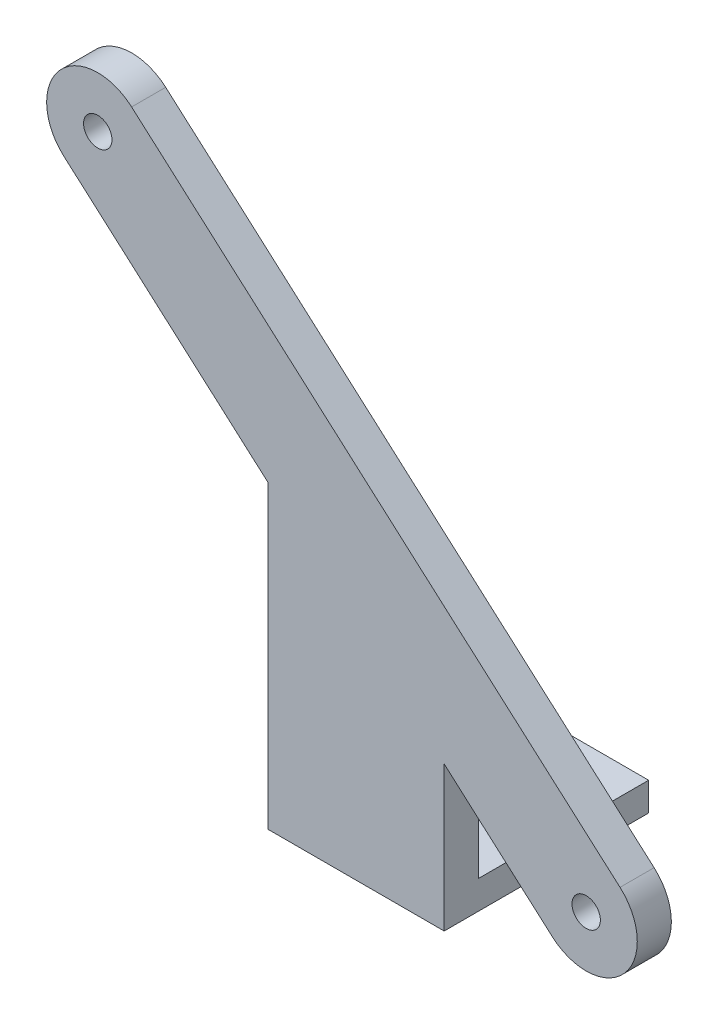
ISO-10303-21;
HEADER;
FILE_DESCRIPTION(('STEP AP214'),'2;1');
FILE_NAME('part.step','',(''),(''),'','','');
FILE_SCHEMA(('AUTOMOTIVE_DESIGN { 1 0 10303 214 1 1 1 1 }'));
ENDSEC;
DATA;
#1=APPLICATION_CONTEXT('core data for automotive mechanical design processes');
#2=APPLICATION_PROTOCOL_DEFINITION('international standard','automotive_design',2000,#1);
#3=PRODUCT_CONTEXT('',#1,'mechanical');
#4=PRODUCT('Part','Part','',(#3));
#5=PRODUCT_RELATED_PRODUCT_CATEGORY('part','',(#4));
#6=PRODUCT_DEFINITION_FORMATION('','',#4);
#7=PRODUCT_DEFINITION_CONTEXT('part definition',#1,'design');
#8=PRODUCT_DEFINITION('design','',#6,#7);
#9=PRODUCT_DEFINITION_SHAPE('','',#8);
#10=(LENGTH_UNIT() NAMED_UNIT(*) SI_UNIT(.MILLI.,.METRE.));
#11=(NAMED_UNIT(*) PLANE_ANGLE_UNIT() SI_UNIT($,.RADIAN.));
#12=(NAMED_UNIT(*) SI_UNIT($,.STERADIAN.) SOLID_ANGLE_UNIT());
#13=UNCERTAINTY_MEASURE_WITH_UNIT(LENGTH_MEASURE(1.E-05),#10,'distance_accuracy_value','');
#14=(GEOMETRIC_REPRESENTATION_CONTEXT(3) GLOBAL_UNCERTAINTY_ASSIGNED_CONTEXT((#13)) GLOBAL_UNIT_ASSIGNED_CONTEXT((#10,
#11,#12)) REPRESENTATION_CONTEXT('',''));
#15=CARTESIAN_POINT('',(0.,0.,0.));
#16=DIRECTION('',(0.,0.,1.));
#17=DIRECTION('',(1.,0.,0.));
#18=AXIS2_PLACEMENT_3D('',#15,#16,#17);
#19=CARTESIAN_POINT('',(0.,0.,0.));
#20=DIRECTION('',(0.,0.,1.));
#21=DIRECTION('',(1.,0.,0.));
#22=AXIS2_PLACEMENT_3D('',#19,#20,#21);
#23=PLANE('',#22);
#24=CARTESIAN_POINT('',(21.5,7.70000000000001,0.));
#25=DIRECTION('',(0.,0.,1.));
#26=DIRECTION('',(1.,0.,0.));
#27=AXIS2_PLACEMENT_3D('',#24,#25,#26);
#28=CIRCLE('',#27,1.25);
#29=CARTESIAN_POINT('',(22.75,7.70000000000001,0.));
#30=VERTEX_POINT('',#29);
#31=EDGE_CURVE('E168',#30,#30,#28,.T.);
#32=ORIENTED_EDGE('',*,*,#31,.T.);
#33=EDGE_LOOP('',(#32));
#34=FACE_BOUND('',#33,.T.);
#35=CARTESIAN_POINT('',(-21.5,45.7,0.));
#36=DIRECTION('',(0.,0.,1.));
#37=DIRECTION('',(1.,0.,0.));
#38=AXIS2_PLACEMENT_3D('',#35,#36,#37);
#39=CIRCLE('',#38,1.25);
#40=CARTESIAN_POINT('',(-20.25,45.7,0.));
#41=VERTEX_POINT('',#40);
#42=EDGE_CURVE('E164',#41,#41,#39,.T.);
#43=ORIENTED_EDGE('',*,*,#42,.T.);
#44=EDGE_LOOP('',(#43));
#45=FACE_BOUND('',#44,.T.);
#46=DIRECTION('',(1.,0.,0.));
#47=VECTOR('',#46,1.);
#48=CARTESIAN_POINT('',(9.,2.5,0.));
#49=LINE('',#48,#47);
#50=CARTESIAN_POINT('',(-6.5,2.5,0.));
#51=VERTEX_POINT('',#50);
#52=CARTESIAN_POINT('',(9.,2.5,0.));
#53=VERTEX_POINT('',#52);
#54=EDGE_CURVE('E60',#51,#53,#49,.T.);
#55=ORIENTED_EDGE('',*,*,#54,.F.);
#56=DIRECTION('',(0.,-1.,0.));
#57=VECTOR('',#56,1.);
#58=CARTESIAN_POINT('',(-6.5,0.,0.));
#59=LINE('',#58,#57);
#60=CARTESIAN_POINT('',(-6.5,26.4388139247148,0.));
#61=VERTEX_POINT('',#60);
#62=EDGE_CURVE('E175',#61,#51,#59,.T.);
#63=ORIENTED_EDGE('',*,*,#62,.F.);
#64=DIRECTION('',(0.749329085481146,-0.662197796471711,0.));
#65=VECTOR('',#64,1.);
#66=CARTESIAN_POINT('',(10.2687585645259,11.6199110072267,0.));
#67=LINE('',#66,#65);
#68=CARTESIAN_POINT('',(-24.4798900841227,42.3280191153348,0.));
#69=VERTEX_POINT('',#68);
#70=EDGE_CURVE('E171',#69,#61,#67,.T.);
#71=ORIENTED_EDGE('',*,*,#70,.F.);
#72=CARTESIAN_POINT('',(-21.5,45.7,0.));
#73=DIRECTION('',(0.,0.,1.));
#74=DIRECTION('',(1.,0.,0.));
#75=AXIS2_PLACEMENT_3D('',#72,#73,#74);
#76=CIRCLE('',#75,4.50000000000001);
#77=CARTESIAN_POINT('',(-18.5201099158773,49.0719808846652,0.));
#78=VERTEX_POINT('',#77);
#79=EDGE_CURVE('E185',#78,#69,#76,.T.);
#80=ORIENTED_EDGE('',*,*,#79,.F.);
#81=DIRECTION('',(0.749329085481146,-0.662197796471711,0.));
#82=VECTOR('',#81,1.);
#83=CARTESIAN_POINT('',(16.2285387327713,18.3638727765571,0.));
#84=LINE('',#83,#82);
#85=CARTESIAN_POINT('',(24.4798900841227,11.0719808846651,0.));
#86=VERTEX_POINT('',#85);
#87=EDGE_CURVE('E182',#78,#86,#84,.T.);
#88=ORIENTED_EDGE('',*,*,#87,.T.);
#89=CARTESIAN_POINT('',(21.5,7.70000000000001,0.));
#90=DIRECTION('',(0.,0.,1.));
#91=DIRECTION('',(1.,0.,0.));
#92=AXIS2_PLACEMENT_3D('',#89,#90,#91);
#93=CIRCLE('',#92,4.50000000000001);
#94=CARTESIAN_POINT('',(18.5201099158773,4.32801911533483,0.));
#95=VERTEX_POINT('',#94);
#96=EDGE_CURVE('E146',#95,#86,#93,.T.);
#97=ORIENTED_EDGE('',*,*,#96,.F.);
#98=CARTESIAN_POINT('',(9.00000000000001,12.7411395061101,0.));
#99=VERTEX_POINT('',#98);
#100=EDGE_CURVE('E176',#99,#95,#67,.T.);
#101=ORIENTED_EDGE('',*,*,#100,.F.);
#102=DIRECTION('',(0.,1.,0.));
#103=VECTOR('',#102,1.);
#104=CARTESIAN_POINT('',(9.,0.,0.));
#105=LINE('',#104,#103);
#106=EDGE_CURVE('E177',#53,#99,#105,.T.);
#107=ORIENTED_EDGE('',*,*,#106,.F.);
#108=EDGE_LOOP('',(#55,#63,#71,#80,#88,#97,#101,#107));
#109=FACE_BOUND('',#108,.T.);
#110=ADVANCED_FACE('F42',(#34,#45,#109),#23,.F.);
#111=CARTESIAN_POINT('',(10.2687585645259,11.6199110072267,3.));
#112=DIRECTION('',(0.662197796471711,0.749329085481146,0.));
#113=DIRECTION('',(-0.749329085481146,0.662197796471711,0.));
#114=AXIS2_PLACEMENT_3D('',#111,#112,#113);
#115=PLANE('',#114);
#116=ORIENTED_EDGE('',*,*,#70,.T.);
#117=DIRECTION('',(0.,0.,-1.));
#118=VECTOR('',#117,1.);
#119=CARTESIAN_POINT('',(-6.5,26.4388139247148,3.));
#120=LINE('',#119,#118);
#121=CARTESIAN_POINT('',(-6.5,26.4388139247148,3.));
#122=VERTEX_POINT('',#121);
#123=EDGE_CURVE('E12',#122,#61,#120,.T.);
#124=ORIENTED_EDGE('',*,*,#123,.F.);
#125=DIRECTION('',(0.749329085481146,-0.662197796471711,0.));
#126=VECTOR('',#125,1.);
#127=CARTESIAN_POINT('',(10.2687585645259,11.6199110072267,3.));
#128=LINE('',#127,#126);
#129=CARTESIAN_POINT('',(-24.4798900841227,42.3280191153348,3.));
#130=VERTEX_POINT('',#129);
#131=EDGE_CURVE('E210',#130,#122,#128,.T.);
#132=ORIENTED_EDGE('',*,*,#131,.F.);
#133=DIRECTION('',(0.,0.,-1.));
#134=VECTOR('',#133,1.);
#135=CARTESIAN_POINT('',(-24.4798900841227,42.3280191153348,3.));
#136=LINE('',#135,#134);
#137=EDGE_CURVE('E160',#130,#69,#136,.T.);
#138=ORIENTED_EDGE('',*,*,#137,.T.);
#139=EDGE_LOOP('',(#116,#124,#132,#138));
#140=FACE_BOUND('',#139,.T.);
#141=ADVANCED_FACE('F287',(#140),#115,.F.);
#142=CARTESIAN_POINT('',(-6.5,0.,3.));
#143=DIRECTION('',(1.,0.,0.));
#144=DIRECTION('',(0.,1.,0.));
#145=AXIS2_PLACEMENT_3D('',#142,#143,#144);
#146=PLANE('',#145);
#147=ORIENTED_EDGE('',*,*,#62,.T.);
#148=DIRECTION('',(0.,0.,1.));
#149=VECTOR('',#148,1.);
#150=CARTESIAN_POINT('',(-6.5,2.5,-15.));
#151=LINE('',#150,#149);
#152=CARTESIAN_POINT('',(-6.5,2.5,-15.));
#153=VERTEX_POINT('',#152);
#154=EDGE_CURVE('E46',#153,#51,#151,.T.);
#155=ORIENTED_EDGE('',*,*,#154,.F.);
#156=DIRECTION('',(0.,1.,0.));
#157=VECTOR('',#156,1.);
#158=CARTESIAN_POINT('',(-6.5,0.,-15.));
#159=LINE('',#158,#157);
#160=CARTESIAN_POINT('',(-6.5,0.,-15.));
#161=VERTEX_POINT('',#160);
#162=EDGE_CURVE('E110',#161,#153,#159,.T.);
#163=ORIENTED_EDGE('',*,*,#162,.F.);
#164=DIRECTION('',(0.,0.,-1.));
#165=VECTOR('',#164,1.);
#166=CARTESIAN_POINT('',(-6.5,0.,3.));
#167=LINE('',#166,#165);
#168=CARTESIAN_POINT('',(-6.5,0.,3.));
#169=VERTEX_POINT('',#168);
#170=EDGE_CURVE('E52',#169,#161,#167,.T.);
#171=ORIENTED_EDGE('',*,*,#170,.F.);
#172=DIRECTION('',(0.,-1.,0.));
#173=VECTOR('',#172,1.);
#174=CARTESIAN_POINT('',(-6.5,0.,3.));
#175=LINE('',#174,#173);
#176=EDGE_CURVE('E206',#122,#169,#175,.T.);
#177=ORIENTED_EDGE('',*,*,#176,.F.);
#178=ORIENTED_EDGE('',*,*,#123,.T.);
#179=EDGE_LOOP('',(#147,#155,#163,#171,#177,#178));
#180=FACE_BOUND('',#179,.T.);
#181=ADVANCED_FACE('F44',(#180),#146,.F.);
#182=CARTESIAN_POINT('',(0.,0.,3.));
#183=DIRECTION('',(0.,1.,0.));
#184=DIRECTION('',(0.,0.,1.));
#185=AXIS2_PLACEMENT_3D('',#182,#183,#184);
#186=PLANE('',#185);
#187=CARTESIAN_POINT('',(-2.28553390593272,0.,-3.96446609406724));
#188=DIRECTION('',(0.,1.,0.));
#189=DIRECTION('',(0.,0.,1.));
#190=AXIS2_PLACEMENT_3D('',#187,#188,#189);
#191=CIRCLE('',#190,1.7);
#192=CARTESIAN_POINT('',(-2.28553390593272,0.,-2.26446609406725));
#193=VERTEX_POINT('',#192);
#194=EDGE_CURVE('E251',#193,#193,#191,.T.);
#195=ORIENTED_EDGE('',*,*,#194,.T.);
#196=EDGE_LOOP('',(#195));
#197=FACE_BOUND('',#196,.T.);
#198=CARTESIAN_POINT('',(4.78553390593272,0.,-11.0355339059328));
#199=DIRECTION('',(0.,1.,0.));
#200=DIRECTION('',(0.,0.,1.));
#201=AXIS2_PLACEMENT_3D('',#198,#199,#200);
#202=CIRCLE('',#201,1.7);
#203=CARTESIAN_POINT('',(4.78553390593272,0.,-9.33553390593276));
#204=VERTEX_POINT('',#203);
#205=EDGE_CURVE('E229',#204,#204,#202,.T.);
#206=ORIENTED_EDGE('',*,*,#205,.T.);
#207=EDGE_LOOP('',(#206));
#208=FACE_BOUND('',#207,.T.);
#209=ORIENTED_EDGE('',*,*,#170,.T.);
#210=DIRECTION('',(-1.,0.,0.));
#211=VECTOR('',#210,1.);
#212=CARTESIAN_POINT('',(9.,0.,-15.));
#213=LINE('',#212,#211);
#214=CARTESIAN_POINT('',(9.,0.,-15.));
#215=VERTEX_POINT('',#214);
#216=EDGE_CURVE('E213',#215,#161,#213,.T.);
#217=ORIENTED_EDGE('',*,*,#216,.F.);
#218=DIRECTION('',(0.,0.,-1.));
#219=VECTOR('',#218,1.);
#220=CARTESIAN_POINT('',(9.,0.,3.));
#221=LINE('',#220,#219);
#222=CARTESIAN_POINT('',(9.,0.,3.));
#223=VERTEX_POINT('',#222);
#224=EDGE_CURVE('E200',#223,#215,#221,.T.);
#225=ORIENTED_EDGE('',*,*,#224,.F.);
#226=DIRECTION('',(1.,0.,0.));
#227=VECTOR('',#226,1.);
#228=CARTESIAN_POINT('',(0.,0.,3.));
#229=LINE('',#228,#227);
#230=EDGE_CURVE('E209',#169,#223,#229,.T.);
#231=ORIENTED_EDGE('',*,*,#230,.F.);
#232=EDGE_LOOP('',(#209,#217,#225,#231));
#233=FACE_BOUND('',#232,.T.);
#234=ADVANCED_FACE('F313',(#197,#208,#233),#186,.F.);
#235=CARTESIAN_POINT('',(9.,0.,3.));
#236=DIRECTION('',(-1.,0.,0.));
#237=DIRECTION('',(0.,-1.,0.));
#238=AXIS2_PLACEMENT_3D('',#235,#236,#237);
#239=PLANE('',#238);
#240=ORIENTED_EDGE('',*,*,#224,.T.);
#241=DIRECTION('',(0.,-1.,0.));
#242=VECTOR('',#241,1.);
#243=CARTESIAN_POINT('',(9.,0.,-15.));
#244=LINE('',#243,#242);
#245=CARTESIAN_POINT('',(9.,2.5,-15.));
#246=VERTEX_POINT('',#245);
#247=EDGE_CURVE('E219',#246,#215,#244,.T.);
#248=ORIENTED_EDGE('',*,*,#247,.F.);
#249=DIRECTION('',(0.,0.,1.));
#250=VECTOR('',#249,1.);
#251=CARTESIAN_POINT('',(9.,2.5,-15.));
#252=LINE('',#251,#250);
#253=EDGE_CURVE('E216',#246,#53,#252,.T.);
#254=ORIENTED_EDGE('',*,*,#253,.T.);
#255=ORIENTED_EDGE('',*,*,#106,.T.);
#256=DIRECTION('',(0.,0.,-1.));
#257=VECTOR('',#256,1.);
#258=CARTESIAN_POINT('',(9.00000000000001,12.7411395061101,3.));
#259=LINE('',#258,#257);
#260=CARTESIAN_POINT('',(9.00000000000001,12.7411395061101,3.));
#261=VERTEX_POINT('',#260);
#262=EDGE_CURVE('E196',#261,#99,#259,.T.);
#263=ORIENTED_EDGE('',*,*,#262,.F.);
#264=DIRECTION('',(0.,1.,0.));
#265=VECTOR('',#264,1.);
#266=CARTESIAN_POINT('',(9.,0.,3.));
#267=LINE('',#266,#265);
#268=EDGE_CURVE('E243',#223,#261,#267,.T.);
#269=ORIENTED_EDGE('',*,*,#268,.F.);
#270=EDGE_LOOP('',(#240,#248,#254,#255,#263,#269));
#271=FACE_BOUND('',#270,.T.);
#272=ADVANCED_FACE('F276',(#271),#239,.F.);
#273=ORIENTED_EDGE('',*,*,#100,.T.);
#274=DIRECTION('',(0.,0.,-1.));
#275=VECTOR('',#274,1.);
#276=CARTESIAN_POINT('',(18.5201099158773,4.32801911533483,3.));
#277=LINE('',#276,#275);
#278=CARTESIAN_POINT('',(18.5201099158773,4.32801911533483,3.));
#279=VERTEX_POINT('',#278);
#280=EDGE_CURVE('E151',#279,#95,#277,.T.);
#281=ORIENTED_EDGE('',*,*,#280,.F.);
#282=EDGE_CURVE('E136',#261,#279,#128,.T.);
#283=ORIENTED_EDGE('',*,*,#282,.F.);
#284=ORIENTED_EDGE('',*,*,#262,.T.);
#285=EDGE_LOOP('',(#273,#281,#283,#284));
#286=FACE_BOUND('',#285,.T.);
#287=ADVANCED_FACE('F295',(#286),#115,.F.);
#288=CARTESIAN_POINT('',(21.5,7.70000000000001,3.));
#289=DIRECTION('',(0.,0.,-1.));
#290=DIRECTION('',(-1.,0.,0.));
#291=AXIS2_PLACEMENT_3D('',#288,#289,#290);
#292=CYLINDRICAL_SURFACE('',#291,4.50000000000001);
#293=ORIENTED_EDGE('',*,*,#96,.T.);
#294=DIRECTION('',(0.,0.,-1.));
#295=VECTOR('',#294,1.);
#296=CARTESIAN_POINT('',(24.4798900841227,11.0719808846651,3.));
#297=LINE('',#296,#295);
#298=CARTESIAN_POINT('',(24.4798900841227,11.0719808846651,3.));
#299=VERTEX_POINT('',#298);
#300=EDGE_CURVE('E143',#299,#86,#297,.T.);
#301=ORIENTED_EDGE('',*,*,#300,.F.);
#302=CARTESIAN_POINT('',(21.5,7.70000000000001,3.));
#303=DIRECTION('',(0.,0.,1.));
#304=DIRECTION('',(1.,0.,0.));
#305=AXIS2_PLACEMENT_3D('',#302,#303,#304);
#306=CIRCLE('',#305,4.50000000000001);
#307=EDGE_CURVE('E130',#279,#299,#306,.T.);
#308=ORIENTED_EDGE('',*,*,#307,.F.);
#309=ORIENTED_EDGE('',*,*,#280,.T.);
#310=EDGE_LOOP('',(#293,#301,#308,#309));
#311=FACE_BOUND('',#310,.T.);
#312=ADVANCED_FACE('F144',(#311),#292,.T.);
#313=CARTESIAN_POINT('',(16.2285387327713,18.3638727765571,3.));
#314=DIRECTION('',(0.662197796471711,0.749329085481146,0.));
#315=DIRECTION('',(-0.749329085481146,0.662197796471711,0.));
#316=AXIS2_PLACEMENT_3D('',#313,#314,#315);
#317=PLANE('',#316);
#318=ORIENTED_EDGE('',*,*,#87,.F.);
#319=DIRECTION('',(0.,0.,-1.));
#320=VECTOR('',#319,1.);
#321=CARTESIAN_POINT('',(-18.5201099158773,49.0719808846652,3.));
#322=LINE('',#321,#320);
#323=CARTESIAN_POINT('',(-18.5201099158773,49.0719808846652,3.));
#324=VERTEX_POINT('',#323);
#325=EDGE_CURVE('E152',#324,#78,#322,.T.);
#326=ORIENTED_EDGE('',*,*,#325,.F.);
#327=DIRECTION('',(0.749329085481146,-0.662197796471711,0.));
#328=VECTOR('',#327,1.);
#329=CARTESIAN_POINT('',(16.2285387327713,18.3638727765571,3.));
#330=LINE('',#329,#328);
#331=EDGE_CURVE('E134',#324,#299,#330,.T.);
#332=ORIENTED_EDGE('',*,*,#331,.T.);
#333=ORIENTED_EDGE('',*,*,#300,.T.);
#334=EDGE_LOOP('',(#318,#326,#332,#333));
#335=FACE_BOUND('',#334,.T.);
#336=ADVANCED_FACE('F154',(#335),#317,.T.);
#337=CARTESIAN_POINT('',(21.5,7.70000000000001,3.));
#338=DIRECTION('',(0.,0.,-1.));
#339=DIRECTION('',(-1.,0.,0.));
#340=AXIS2_PLACEMENT_3D('',#337,#338,#339);
#341=CYLINDRICAL_SURFACE('',#340,1.25);
#342=CARTESIAN_POINT('',(21.5,7.70000000000001,3.));
#343=DIRECTION('',(0.,0.,1.));
#344=DIRECTION('',(1.,0.,0.));
#345=AXIS2_PLACEMENT_3D('',#342,#343,#344);
#346=CIRCLE('',#345,1.25);
#347=CARTESIAN_POINT('',(22.75,7.70000000000001,3.));
#348=VERTEX_POINT('',#347);
#349=EDGE_CURVE('E236',#348,#348,#346,.T.);
#350=ORIENTED_EDGE('',*,*,#349,.T.);
#351=EDGE_LOOP('',(#350));
#352=FACE_BOUND('',#351,.T.);
#353=ORIENTED_EDGE('',*,*,#31,.F.);
#354=EDGE_LOOP('',(#353));
#355=FACE_BOUND('',#354,.T.);
#356=ADVANCED_FACE('F306',(#352,#355),#341,.F.);
#357=CARTESIAN_POINT('',(-21.5,45.7,3.));
#358=DIRECTION('',(0.,0.,-1.));
#359=DIRECTION('',(-1.,0.,0.));
#360=AXIS2_PLACEMENT_3D('',#357,#358,#359);
#361=CYLINDRICAL_SURFACE('',#360,1.25);
#362=CARTESIAN_POINT('',(-21.5,45.7,3.));
#363=DIRECTION('',(0.,0.,1.));
#364=DIRECTION('',(1.,0.,0.));
#365=AXIS2_PLACEMENT_3D('',#362,#363,#364);
#366=CIRCLE('',#365,1.25);
#367=CARTESIAN_POINT('',(-20.25,45.7,3.));
#368=VERTEX_POINT('',#367);
#369=EDGE_CURVE('E188',#368,#368,#366,.T.);
#370=ORIENTED_EDGE('',*,*,#369,.T.);
#371=EDGE_LOOP('',(#370));
#372=FACE_BOUND('',#371,.T.);
#373=ORIENTED_EDGE('',*,*,#42,.F.);
#374=EDGE_LOOP('',(#373));
#375=FACE_BOUND('',#374,.T.);
#376=ADVANCED_FACE('F302',(#372,#375),#361,.F.);
#377=CARTESIAN_POINT('',(-21.5,45.7,3.));
#378=DIRECTION('',(0.,0.,-1.));
#379=DIRECTION('',(-1.,0.,0.));
#380=AXIS2_PLACEMENT_3D('',#377,#378,#379);
#381=CYLINDRICAL_SURFACE('',#380,4.50000000000001);
#382=ORIENTED_EDGE('',*,*,#79,.T.);
#383=ORIENTED_EDGE('',*,*,#137,.F.);
#384=CARTESIAN_POINT('',(-21.5,45.7,3.));
#385=DIRECTION('',(0.,0.,1.));
#386=DIRECTION('',(1.,0.,0.));
#387=AXIS2_PLACEMENT_3D('',#384,#385,#386);
#388=CIRCLE('',#387,4.50000000000001);
#389=EDGE_CURVE('E69',#324,#130,#388,.T.);
#390=ORIENTED_EDGE('',*,*,#389,.F.);
#391=ORIENTED_EDGE('',*,*,#325,.T.);
#392=EDGE_LOOP('',(#382,#383,#390,#391));
#393=FACE_BOUND('',#392,.T.);
#394=ADVANCED_FACE('F299',(#393),#381,.T.);
#395=CARTESIAN_POINT('',(0.,0.,3.));
#396=DIRECTION('',(0.,0.,1.));
#397=DIRECTION('',(1.,0.,0.));
#398=AXIS2_PLACEMENT_3D('',#395,#396,#397);
#399=PLANE('',#398);
#400=ORIENTED_EDGE('',*,*,#369,.F.);
#401=EDGE_LOOP('',(#400));
#402=FACE_BOUND('',#401,.T.);
#403=ORIENTED_EDGE('',*,*,#349,.F.);
#404=EDGE_LOOP('',(#403));
#405=FACE_BOUND('',#404,.T.);
#406=ORIENTED_EDGE('',*,*,#131,.T.);
#407=ORIENTED_EDGE('',*,*,#176,.T.);
#408=ORIENTED_EDGE('',*,*,#230,.T.);
#409=ORIENTED_EDGE('',*,*,#268,.T.);
#410=ORIENTED_EDGE('',*,*,#282,.T.);
#411=ORIENTED_EDGE('',*,*,#307,.T.);
#412=ORIENTED_EDGE('',*,*,#331,.F.);
#413=ORIENTED_EDGE('',*,*,#389,.T.);
#414=EDGE_LOOP('',(#406,#407,#408,#409,#410,#411,#412,#413));
#415=FACE_BOUND('',#414,.T.);
#416=ADVANCED_FACE('F132',(#402,#405,#415),#399,.T.);
#417=CARTESIAN_POINT('',(9.,2.5,-15.));
#418=DIRECTION('',(0.,-1.,0.));
#419=DIRECTION('',(0.,0.,-1.));
#420=AXIS2_PLACEMENT_3D('',#417,#418,#419);
#421=PLANE('',#420);
#422=CARTESIAN_POINT('',(-2.28553390593272,2.5,-3.96446609406724));
#423=DIRECTION('',(0.,1.,0.));
#424=DIRECTION('',(0.,0.,1.));
#425=AXIS2_PLACEMENT_3D('',#422,#423,#424);
#426=CIRCLE('',#425,1.69999999999999);
#427=CARTESIAN_POINT('',(-2.28553390593272,2.5,-2.26446609406725));
#428=VERTEX_POINT('',#427);
#429=EDGE_CURVE('E258',#428,#428,#426,.T.);
#430=ORIENTED_EDGE('',*,*,#429,.F.);
#431=EDGE_LOOP('',(#430));
#432=FACE_BOUND('',#431,.T.);
#433=CARTESIAN_POINT('',(4.78553390593272,2.5,-11.0355339059328));
#434=DIRECTION('',(0.,1.,0.));
#435=DIRECTION('',(0.,0.,1.));
#436=AXIS2_PLACEMENT_3D('',#433,#434,#435);
#437=CIRCLE('',#436,1.69999999999999);
#438=CARTESIAN_POINT('',(4.78553390593272,2.5,-9.33553390593276));
#439=VERTEX_POINT('',#438);
#440=EDGE_CURVE('E249',#439,#439,#437,.T.);
#441=ORIENTED_EDGE('',*,*,#440,.F.);
#442=EDGE_LOOP('',(#441));
#443=FACE_BOUND('',#442,.T.);
#444=ORIENTED_EDGE('',*,*,#54,.T.);
#445=ORIENTED_EDGE('',*,*,#253,.F.);
#446=DIRECTION('',(1.,0.,0.));
#447=VECTOR('',#446,1.);
#448=CARTESIAN_POINT('',(9.,2.5,-15.));
#449=LINE('',#448,#447);
#450=EDGE_CURVE('E115',#153,#246,#449,.T.);
#451=ORIENTED_EDGE('',*,*,#450,.F.);
#452=ORIENTED_EDGE('',*,*,#154,.T.);
#453=EDGE_LOOP('',(#444,#445,#451,#452));
#454=FACE_BOUND('',#453,.T.);
#455=ADVANCED_FACE('F267',(#432,#443,#454),#421,.F.);
#456=CARTESIAN_POINT('',(0.,0.,-15.));
#457=DIRECTION('',(0.,0.,1.));
#458=DIRECTION('',(1.,0.,0.));
#459=AXIS2_PLACEMENT_3D('',#456,#457,#458);
#460=PLANE('',#459);
#461=ORIENTED_EDGE('',*,*,#247,.T.);
#462=ORIENTED_EDGE('',*,*,#216,.T.);
#463=ORIENTED_EDGE('',*,*,#162,.T.);
#464=ORIENTED_EDGE('',*,*,#450,.T.);
#465=EDGE_LOOP('',(#461,#462,#463,#464));
#466=FACE_BOUND('',#465,.T.);
#467=ADVANCED_FACE('F270',(#466),#460,.F.);
#468=CARTESIAN_POINT('',(4.78553390593272,2.5,-11.0355339059328));
#469=DIRECTION('',(0.,1.,0.));
#470=DIRECTION('',(0.,0.,1.));
#471=AXIS2_PLACEMENT_3D('',#468,#469,#470);
#472=CYLINDRICAL_SURFACE('',#471,1.7);
#473=ORIENTED_EDGE('',*,*,#205,.F.);
#474=EDGE_LOOP('',(#473));
#475=FACE_BOUND('',#474,.T.);
#476=ORIENTED_EDGE('',*,*,#440,.T.);
#477=EDGE_LOOP('',(#476));
#478=FACE_BOUND('',#477,.T.);
#479=ADVANCED_FACE('F279',(#475,#478),#472,.F.);
#480=CARTESIAN_POINT('',(-2.28553390593272,2.5,-3.96446609406724));
#481=DIRECTION('',(0.,1.,0.));
#482=DIRECTION('',(0.,0.,1.));
#483=AXIS2_PLACEMENT_3D('',#480,#481,#482);
#484=CYLINDRICAL_SURFACE('',#483,1.7);
#485=ORIENTED_EDGE('',*,*,#194,.F.);
#486=EDGE_LOOP('',(#485));
#487=FACE_BOUND('',#486,.T.);
#488=ORIENTED_EDGE('',*,*,#429,.T.);
#489=EDGE_LOOP('',(#488));
#490=FACE_BOUND('',#489,.T.);
#491=ADVANCED_FACE('F265',(#487,#490),#484,.F.);
#492=CLOSED_SHELL('',(#110,#141,#181,#234,#272,#287,#312,#336,#356,#376,#394,#416,#455,#467,
#479,#491));
#493=MANIFOLD_SOLID_BREP('B2',#492);
#494=ADVANCED_BREP_SHAPE_REPRESENTATION('',(#18,#493),#14);
#495=SHAPE_DEFINITION_REPRESENTATION(#9,#494);
ENDSEC;
END-ISO-10303-21;
